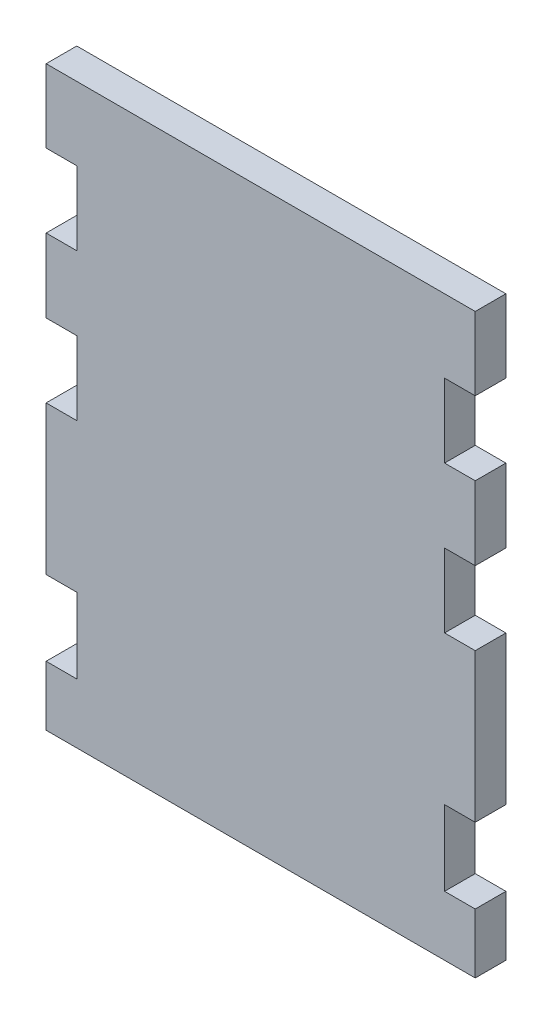
ISO-10303-21;
HEADER;
FILE_DESCRIPTION(('STEP AP214'),'2;1');
FILE_NAME('part.step','',(''),(''),'','','');
FILE_SCHEMA(('AUTOMOTIVE_DESIGN { 1 0 10303 214 1 1 1 1 }'));
ENDSEC;
DATA;
#1=APPLICATION_CONTEXT('core data for automotive mechanical design processes');
#2=APPLICATION_PROTOCOL_DEFINITION('international standard','automotive_design',2000,#1);
#3=PRODUCT_CONTEXT('',#1,'mechanical');
#4=PRODUCT('Part','Part','',(#3));
#5=PRODUCT_RELATED_PRODUCT_CATEGORY('part','',(#4));
#6=PRODUCT_DEFINITION_FORMATION('','',#4);
#7=PRODUCT_DEFINITION_CONTEXT('part definition',#1,'design');
#8=PRODUCT_DEFINITION('design','',#6,#7);
#9=PRODUCT_DEFINITION_SHAPE('','',#8);
#10=(LENGTH_UNIT() NAMED_UNIT(*) SI_UNIT(.MILLI.,.METRE.));
#11=(NAMED_UNIT(*) PLANE_ANGLE_UNIT() SI_UNIT($,.RADIAN.));
#12=(NAMED_UNIT(*) SI_UNIT($,.STERADIAN.) SOLID_ANGLE_UNIT());
#13=UNCERTAINTY_MEASURE_WITH_UNIT(LENGTH_MEASURE(1.E-05),#10,'distance_accuracy_value','');
#14=(GEOMETRIC_REPRESENTATION_CONTEXT(3) GLOBAL_UNCERTAINTY_ASSIGNED_CONTEXT((#13)) GLOBAL_UNIT_ASSIGNED_CONTEXT((#10,
#11,#12)) REPRESENTATION_CONTEXT('',''));
#15=CARTESIAN_POINT('',(0.,0.,0.));
#16=DIRECTION('',(0.,0.,1.));
#17=DIRECTION('',(1.,0.,0.));
#18=AXIS2_PLACEMENT_3D('',#15,#16,#17);
#19=CARTESIAN_POINT('',(0.,0.,3.));
#20=DIRECTION('',(1.,0.,0.));
#21=DIRECTION('',(0.,0.,-1.));
#22=AXIS2_PLACEMENT_3D('',#19,#20,#21);
#23=PLANE('',#22);
#24=DIRECTION('',(0.,-1.,0.));
#25=VECTOR('',#24,1.);
#26=CARTESIAN_POINT('',(0.,0.,0.));
#27=LINE('',#26,#25);
#28=CARTESIAN_POINT('',(0.,7.34818586641541,0.));
#29=VERTEX_POINT('',#28);
#30=CARTESIAN_POINT('',(0.,1.5,0.));
#31=VERTEX_POINT('',#30);
#32=EDGE_CURVE('E267',#29,#31,#27,.T.);
#33=ORIENTED_EDGE('',*,*,#32,.T.);
#34=DIRECTION('',(0.,0.,1.));
#35=VECTOR('',#34,1.);
#36=CARTESIAN_POINT('',(0.,1.5,0.));
#37=LINE('',#36,#35);
#38=CARTESIAN_POINT('',(0.,1.5,3.));
#39=VERTEX_POINT('',#38);
#40=EDGE_CURVE('E58',#31,#39,#37,.T.);
#41=ORIENTED_EDGE('',*,*,#40,.T.);
#42=DIRECTION('',(0.,-1.,0.));
#43=VECTOR('',#42,1.);
#44=CARTESIAN_POINT('',(0.,0.,3.));
#45=LINE('',#44,#43);
#46=CARTESIAN_POINT('',(0.,7.34818586641541,3.));
#47=VERTEX_POINT('',#46);
#48=EDGE_CURVE('E254',#47,#39,#45,.T.);
#49=ORIENTED_EDGE('',*,*,#48,.F.);
#50=DIRECTION('',(0.,0.,1.));
#51=VECTOR('',#50,1.);
#52=CARTESIAN_POINT('',(0.,7.34818586641541,0.));
#53=LINE('',#52,#51);
#54=EDGE_CURVE('E347',#29,#47,#53,.T.);
#55=ORIENTED_EDGE('',*,*,#54,.F.);
#56=EDGE_LOOP('',(#33,#41,#49,#55));
#57=FACE_BOUND('',#56,.T.);
#58=ADVANCED_FACE('F43',(#57),#23,.F.);
#59=CARTESIAN_POINT('',(0.,29.2481858590005,0.));
#60=VERTEX_POINT('',#59);
#61=CARTESIAN_POINT('',(0.,14.6981858664154,0.));
#62=VERTEX_POINT('',#61);
#63=EDGE_CURVE('E273',#60,#62,#27,.T.);
#64=ORIENTED_EDGE('',*,*,#63,.T.);
#65=DIRECTION('',(0.,0.,1.));
#66=VECTOR('',#65,1.);
#67=CARTESIAN_POINT('',(0.,14.6981858664154,0.));
#68=LINE('',#67,#66);
#69=CARTESIAN_POINT('',(0.,14.6981858664154,3.));
#70=VERTEX_POINT('',#69);
#71=EDGE_CURVE('E344',#62,#70,#68,.T.);
#72=ORIENTED_EDGE('',*,*,#71,.T.);
#73=CARTESIAN_POINT('',(0.,29.2481858590005,3.));
#74=VERTEX_POINT('',#73);
#75=EDGE_CURVE('E522',#74,#70,#45,.T.);
#76=ORIENTED_EDGE('',*,*,#75,.F.);
#77=DIRECTION('',(0.,0.,1.));
#78=VECTOR('',#77,1.);
#79=CARTESIAN_POINT('',(0.,29.2481858590005,0.));
#80=LINE('',#79,#78);
#81=EDGE_CURVE('E507',#60,#74,#80,.T.);
#82=ORIENTED_EDGE('',*,*,#81,.F.);
#83=EDGE_LOOP('',(#64,#72,#76,#82));
#84=FACE_BOUND('',#83,.T.);
#85=ADVANCED_FACE('F577',(#84),#23,.F.);
#86=CARTESIAN_POINT('',(0.,43.6481858518191,0.));
#87=VERTEX_POINT('',#86);
#88=CARTESIAN_POINT('',(0.,36.4481858554098,0.));
#89=VERTEX_POINT('',#88);
#90=EDGE_CURVE('E266',#87,#89,#27,.T.);
#91=ORIENTED_EDGE('',*,*,#90,.T.);
#92=DIRECTION('',(0.,0.,1.));
#93=VECTOR('',#92,1.);
#94=CARTESIAN_POINT('',(0.,36.4481858554098,0.));
#95=LINE('',#94,#93);
#96=CARTESIAN_POINT('',(0.,36.4481858554098,3.));
#97=VERTEX_POINT('',#96);
#98=EDGE_CURVE('E505',#89,#97,#95,.T.);
#99=ORIENTED_EDGE('',*,*,#98,.T.);
#100=CARTESIAN_POINT('',(0.,43.6481858518191,3.));
#101=VERTEX_POINT('',#100);
#102=EDGE_CURVE('E300',#101,#97,#45,.T.);
#103=ORIENTED_EDGE('',*,*,#102,.F.);
#104=DIRECTION('',(0.,0.,1.));
#105=VECTOR('',#104,1.);
#106=CARTESIAN_POINT('',(0.,43.6481858518191,0.));
#107=LINE('',#106,#105);
#108=EDGE_CURVE('E432',#87,#101,#107,.T.);
#109=ORIENTED_EDGE('',*,*,#108,.F.);
#110=EDGE_LOOP('',(#91,#99,#103,#109));
#111=FACE_BOUND('',#110,.T.);
#112=ADVANCED_FACE('F499',(#111),#23,.F.);
#113=CARTESIAN_POINT('',(42.,0.,3.));
#114=DIRECTION('',(-1.,0.,0.));
#115=DIRECTION('',(0.,0.,1.));
#116=AXIS2_PLACEMENT_3D('',#113,#114,#115);
#117=PLANE('',#116);
#118=DIRECTION('',(0.,1.,0.));
#119=VECTOR('',#118,1.);
#120=CARTESIAN_POINT('',(42.,0.,3.));
#121=LINE('',#120,#119);
#122=CARTESIAN_POINT('',(42.,36.4481858554098,3.));
#123=VERTEX_POINT('',#122);
#124=CARTESIAN_POINT('',(42.,43.6481858518191,3.));
#125=VERTEX_POINT('',#124);
#126=EDGE_CURVE('E465',#123,#125,#121,.T.);
#127=ORIENTED_EDGE('',*,*,#126,.F.);
#128=DIRECTION('',(0.,0.,1.));
#129=VECTOR('',#128,1.);
#130=CARTESIAN_POINT('',(42.,36.4481858554098,0.));
#131=LINE('',#130,#129);
#132=CARTESIAN_POINT('',(42.,36.4481858554098,0.));
#133=VERTEX_POINT('',#132);
#134=EDGE_CURVE('E378',#133,#123,#131,.T.);
#135=ORIENTED_EDGE('',*,*,#134,.F.);
#136=DIRECTION('',(0.,1.,0.));
#137=VECTOR('',#136,1.);
#138=CARTESIAN_POINT('',(42.,0.,0.));
#139=LINE('',#138,#137);
#140=CARTESIAN_POINT('',(42.,43.6481858518191,0.));
#141=VERTEX_POINT('',#140);
#142=EDGE_CURVE('E257',#133,#141,#139,.T.);
#143=ORIENTED_EDGE('',*,*,#142,.T.);
#144=DIRECTION('',(0.,0.,1.));
#145=VECTOR('',#144,1.);
#146=CARTESIAN_POINT('',(42.,43.6481858518191,0.));
#147=LINE('',#146,#145);
#148=EDGE_CURVE('E66',#141,#125,#147,.T.);
#149=ORIENTED_EDGE('',*,*,#148,.T.);
#150=EDGE_LOOP('',(#127,#135,#143,#149));
#151=FACE_BOUND('',#150,.T.);
#152=ADVANCED_FACE('F587',(#151),#117,.F.);
#153=CARTESIAN_POINT('',(42.,14.6981858664154,0.));
#154=VERTEX_POINT('',#153);
#155=CARTESIAN_POINT('',(42.,29.2481858590005,0.));
#156=VERTEX_POINT('',#155);
#157=EDGE_CURVE('E251',#154,#156,#139,.T.);
#158=ORIENTED_EDGE('',*,*,#157,.T.);
#159=DIRECTION('',(0.,0.,1.));
#160=VECTOR('',#159,1.);
#161=CARTESIAN_POINT('',(42.,29.2481858590005,0.));
#162=LINE('',#161,#160);
#163=CARTESIAN_POINT('',(42.,29.2481858590005,3.));
#164=VERTEX_POINT('',#163);
#165=EDGE_CURVE('E375',#156,#164,#162,.T.);
#166=ORIENTED_EDGE('',*,*,#165,.T.);
#167=CARTESIAN_POINT('',(42.,14.6981858664154,3.));
#168=VERTEX_POINT('',#167);
#169=EDGE_CURVE('E457',#168,#164,#121,.T.);
#170=ORIENTED_EDGE('',*,*,#169,.F.);
#171=DIRECTION('',(0.,0.,1.));
#172=VECTOR('',#171,1.);
#173=CARTESIAN_POINT('',(42.,14.6981858664154,0.));
#174=LINE('',#173,#172);
#175=EDGE_CURVE('E529',#154,#168,#174,.T.);
#176=ORIENTED_EDGE('',*,*,#175,.F.);
#177=EDGE_LOOP('',(#158,#166,#170,#176));
#178=FACE_BOUND('',#177,.T.);
#179=ADVANCED_FACE('F455',(#178),#117,.F.);
#180=CARTESIAN_POINT('',(42.,50.8481858482284,3.));
#181=VERTEX_POINT('',#180);
#182=CARTESIAN_POINT('',(42.,58.,3.));
#183=VERTEX_POINT('',#182);
#184=EDGE_CURVE('E299',#181,#183,#121,.T.);
#185=ORIENTED_EDGE('',*,*,#184,.F.);
#186=DIRECTION('',(0.,0.,1.));
#187=VECTOR('',#186,1.);
#188=CARTESIAN_POINT('',(42.,50.8481858482284,0.));
#189=LINE('',#188,#187);
#190=CARTESIAN_POINT('',(42.,50.8481858482284,0.));
#191=VERTEX_POINT('',#190);
#192=EDGE_CURVE('E279',#191,#181,#189,.T.);
#193=ORIENTED_EDGE('',*,*,#192,.F.);
#194=CARTESIAN_POINT('',(42.,58.,0.));
#195=VERTEX_POINT('',#194);
#196=EDGE_CURVE('E253',#191,#195,#139,.T.);
#197=ORIENTED_EDGE('',*,*,#196,.T.);
#198=DIRECTION('',(0.,0.,-1.));
#199=VECTOR('',#198,1.);
#200=CARTESIAN_POINT('',(42.,58.,3.));
#201=LINE('',#200,#199);
#202=EDGE_CURVE('E12',#183,#195,#201,.T.);
#203=ORIENTED_EDGE('',*,*,#202,.F.);
#204=EDGE_LOOP('',(#185,#193,#197,#203));
#205=FACE_BOUND('',#204,.T.);
#206=ADVANCED_FACE('F476',(#205),#117,.F.);
#207=CARTESIAN_POINT('',(0.,58.,0.));
#208=VERTEX_POINT('',#207);
#209=CARTESIAN_POINT('',(0.,50.8481858482284,0.));
#210=VERTEX_POINT('',#209);
#211=EDGE_CURVE('E259',#208,#210,#27,.T.);
#212=ORIENTED_EDGE('',*,*,#211,.T.);
#213=DIRECTION('',(0.,0.,1.));
#214=VECTOR('',#213,1.);
#215=CARTESIAN_POINT('',(0.,50.8481858482284,0.));
#216=LINE('',#215,#214);
#217=CARTESIAN_POINT('',(0.,50.8481858482284,3.));
#218=VERTEX_POINT('',#217);
#219=EDGE_CURVE('E434',#210,#218,#216,.T.);
#220=ORIENTED_EDGE('',*,*,#219,.T.);
#221=CARTESIAN_POINT('',(0.,58.,3.));
#222=VERTEX_POINT('',#221);
#223=EDGE_CURVE('E295',#222,#218,#45,.T.);
#224=ORIENTED_EDGE('',*,*,#223,.F.);
#225=DIRECTION('',(0.,0.,-1.));
#226=VECTOR('',#225,1.);
#227=CARTESIAN_POINT('',(0.,58.,3.));
#228=LINE('',#227,#226);
#229=EDGE_CURVE('E51',#222,#208,#228,.T.);
#230=ORIENTED_EDGE('',*,*,#229,.T.);
#231=EDGE_LOOP('',(#212,#220,#224,#230));
#232=FACE_BOUND('',#231,.T.);
#233=ADVANCED_FACE('F45',(#232),#23,.F.);
#234=CARTESIAN_POINT('',(42.,1.5,3.));
#235=VERTEX_POINT('',#234);
#236=CARTESIAN_POINT('',(42.,7.34818586641541,3.));
#237=VERTEX_POINT('',#236);
#238=EDGE_CURVE('E243',#235,#237,#121,.T.);
#239=ORIENTED_EDGE('',*,*,#238,.F.);
#240=DIRECTION('',(0.,0.,1.));
#241=VECTOR('',#240,1.);
#242=CARTESIAN_POINT('',(42.,1.5,0.));
#243=LINE('',#242,#241);
#244=CARTESIAN_POINT('',(42.,1.5,0.));
#245=VERTEX_POINT('',#244);
#246=EDGE_CURVE('E229',#245,#235,#243,.T.);
#247=ORIENTED_EDGE('',*,*,#246,.F.);
#248=CARTESIAN_POINT('',(42.,7.34818586641541,0.));
#249=VERTEX_POINT('',#248);
#250=EDGE_CURVE('E241',#245,#249,#139,.T.);
#251=ORIENTED_EDGE('',*,*,#250,.T.);
#252=DIRECTION('',(0.,0.,1.));
#253=VECTOR('',#252,1.);
#254=CARTESIAN_POINT('',(42.,7.34818586641541,0.));
#255=LINE('',#254,#253);
#256=EDGE_CURVE('E537',#249,#237,#255,.T.);
#257=ORIENTED_EDGE('',*,*,#256,.T.);
#258=EDGE_LOOP('',(#239,#247,#251,#257));
#259=FACE_BOUND('',#258,.T.);
#260=ADVANCED_FACE('F239',(#259),#117,.F.);
#261=CARTESIAN_POINT('',(0.,58.,3.));
#262=DIRECTION('',(0.,-1.,0.));
#263=DIRECTION('',(0.,0.,-1.));
#264=AXIS2_PLACEMENT_3D('',#261,#262,#263);
#265=PLANE('',#264);
#266=DIRECTION('',(-1.,0.,0.));
#267=VECTOR('',#266,1.);
#268=CARTESIAN_POINT('',(0.,58.,0.));
#269=LINE('',#268,#267);
#270=EDGE_CURVE('E250',#195,#208,#269,.T.);
#271=ORIENTED_EDGE('',*,*,#270,.T.);
#272=ORIENTED_EDGE('',*,*,#229,.F.);
#273=DIRECTION('',(-1.,0.,0.));
#274=VECTOR('',#273,1.);
#275=CARTESIAN_POINT('',(0.,58.,3.));
#276=LINE('',#275,#274);
#277=EDGE_CURVE('E466',#183,#222,#276,.T.);
#278=ORIENTED_EDGE('',*,*,#277,.F.);
#279=ORIENTED_EDGE('',*,*,#202,.T.);
#280=EDGE_LOOP('',(#271,#272,#278,#279));
#281=FACE_BOUND('',#280,.T.);
#282=ADVANCED_FACE('F479',(#281),#265,.F.);
#283=CARTESIAN_POINT('',(0.,0.,3.));
#284=DIRECTION('',(0.,0.,-1.));
#285=DIRECTION('',(-1.,0.,0.));
#286=AXIS2_PLACEMENT_3D('',#283,#284,#285);
#287=PLANE('',#286);
#288=ORIENTED_EDGE('',*,*,#48,.T.);
#289=DIRECTION('',(-1.,0.,0.));
#290=VECTOR('',#289,1.);
#291=CARTESIAN_POINT('',(0.,1.5,3.));
#292=LINE('',#291,#290);
#293=EDGE_CURVE('E235',#235,#39,#292,.T.);
#294=ORIENTED_EDGE('',*,*,#293,.F.);
#295=ORIENTED_EDGE('',*,*,#238,.T.);
#296=DIRECTION('',(1.,0.,0.));
#297=VECTOR('',#296,1.);
#298=CARTESIAN_POINT('',(38.9999999999977,7.34818586641541,3.));
#299=LINE('',#298,#297);
#300=CARTESIAN_POINT('',(38.9999999999977,7.34818586641541,3.));
#301=VERTEX_POINT('',#300);
#302=EDGE_CURVE('E542',#301,#237,#299,.T.);
#303=ORIENTED_EDGE('',*,*,#302,.F.);
#304=DIRECTION('',(0.,-1.,0.));
#305=VECTOR('',#304,1.);
#306=CARTESIAN_POINT('',(38.9999999999977,14.6981858664154,3.));
#307=LINE('',#306,#305);
#308=CARTESIAN_POINT('',(38.9999999999977,14.6981858664154,3.));
#309=VERTEX_POINT('',#308);
#310=EDGE_CURVE('E350',#309,#301,#307,.T.);
#311=ORIENTED_EDGE('',*,*,#310,.F.);
#312=DIRECTION('',(-1.,0.,0.));
#313=VECTOR('',#312,1.);
#314=CARTESIAN_POINT('',(38.9999999999977,14.6981858664154,3.));
#315=LINE('',#314,#313);
#316=EDGE_CURVE('E464',#168,#309,#315,.T.);
#317=ORIENTED_EDGE('',*,*,#316,.F.);
#318=ORIENTED_EDGE('',*,*,#169,.T.);
#319=DIRECTION('',(1.,0.,0.));
#320=VECTOR('',#319,1.);
#321=CARTESIAN_POINT('',(38.9999999999977,29.2481858590005,3.));
#322=LINE('',#321,#320);
#323=CARTESIAN_POINT('',(38.9999999999977,29.2481858590005,3.));
#324=VERTEX_POINT('',#323);
#325=EDGE_CURVE('E387',#324,#164,#322,.T.);
#326=ORIENTED_EDGE('',*,*,#325,.F.);
#327=DIRECTION('',(0.,-1.,0.));
#328=VECTOR('',#327,1.);
#329=CARTESIAN_POINT('',(38.9999999999977,36.4481858554098,3.));
#330=LINE('',#329,#328);
#331=CARTESIAN_POINT('',(38.9999999999977,36.4481858554098,3.));
#332=VERTEX_POINT('',#331);
#333=EDGE_CURVE('E404',#332,#324,#330,.T.);
#334=ORIENTED_EDGE('',*,*,#333,.F.);
#335=DIRECTION('',(-1.,0.,0.));
#336=VECTOR('',#335,1.);
#337=CARTESIAN_POINT('',(38.9999999999977,36.4481858554098,3.));
#338=LINE('',#337,#336);
#339=EDGE_CURVE('E383',#123,#332,#338,.T.);
#340=ORIENTED_EDGE('',*,*,#339,.F.);
#341=ORIENTED_EDGE('',*,*,#126,.T.);
#342=DIRECTION('',(1.,0.,0.));
#343=VECTOR('',#342,1.);
#344=CARTESIAN_POINT('',(38.9999999999977,43.6481858518191,3.));
#345=LINE('',#344,#343);
#346=CARTESIAN_POINT('',(38.9999999999977,43.6481858518191,3.));
#347=VERTEX_POINT('',#346);
#348=EDGE_CURVE('E399',#347,#125,#345,.T.);
#349=ORIENTED_EDGE('',*,*,#348,.F.);
#350=DIRECTION('',(0.,-1.,0.));
#351=VECTOR('',#350,1.);
#352=CARTESIAN_POINT('',(38.9999999999977,50.8481858482284,3.));
#353=LINE('',#352,#351);
#354=CARTESIAN_POINT('',(38.9999999999977,50.8481858482284,3.));
#355=VERTEX_POINT('',#354);
#356=EDGE_CURVE('E401',#355,#347,#353,.T.);
#357=ORIENTED_EDGE('',*,*,#356,.F.);
#358=DIRECTION('',(-1.,0.,0.));
#359=VECTOR('',#358,1.);
#360=CARTESIAN_POINT('',(38.9999999999977,50.8481858482284,3.));
#361=LINE('',#360,#359);
#362=EDGE_CURVE('E287',#181,#355,#361,.T.);
#363=ORIENTED_EDGE('',*,*,#362,.F.);
#364=ORIENTED_EDGE('',*,*,#184,.T.);
#365=ORIENTED_EDGE('',*,*,#277,.T.);
#366=ORIENTED_EDGE('',*,*,#223,.T.);
#367=DIRECTION('',(-1.,0.,0.));
#368=VECTOR('',#367,1.);
#369=CARTESIAN_POINT('',(3.00000000000001,50.8481858482284,3.));
#370=LINE('',#369,#368);
#371=CARTESIAN_POINT('',(3.00000000000001,50.8481858482284,3.));
#372=VERTEX_POINT('',#371);
#373=EDGE_CURVE('E426',#372,#218,#370,.T.);
#374=ORIENTED_EDGE('',*,*,#373,.F.);
#375=DIRECTION('',(0.,1.,0.));
#376=VECTOR('',#375,1.);
#377=CARTESIAN_POINT('',(3.00000000000001,50.8481858482284,3.));
#378=LINE('',#377,#376);
#379=CARTESIAN_POINT('',(3.00000000000001,43.6481858518191,3.));
#380=VERTEX_POINT('',#379);
#381=EDGE_CURVE('E382',#380,#372,#378,.T.);
#382=ORIENTED_EDGE('',*,*,#381,.F.);
#383=DIRECTION('',(1.,0.,0.));
#384=VECTOR('',#383,1.);
#385=CARTESIAN_POINT('',(3.00000000000001,43.6481858518191,3.));
#386=LINE('',#385,#384);
#387=EDGE_CURVE('E415',#101,#380,#386,.T.);
#388=ORIENTED_EDGE('',*,*,#387,.F.);
#389=ORIENTED_EDGE('',*,*,#102,.T.);
#390=DIRECTION('',(-1.,0.,0.));
#391=VECTOR('',#390,1.);
#392=CARTESIAN_POINT('',(3.00000000000001,36.4481858554098,3.));
#393=LINE('',#392,#391);
#394=CARTESIAN_POINT('',(3.00000000000001,36.4481858554098,3.));
#395=VERTEX_POINT('',#394);
#396=EDGE_CURVE('E320',#395,#97,#393,.T.);
#397=ORIENTED_EDGE('',*,*,#396,.F.);
#398=DIRECTION('',(0.,1.,0.));
#399=VECTOR('',#398,1.);
#400=CARTESIAN_POINT('',(3.00000000000001,36.4481858554098,3.));
#401=LINE('',#400,#399);
#402=CARTESIAN_POINT('',(3.00000000000001,29.2481858590005,3.));
#403=VERTEX_POINT('',#402);
#404=EDGE_CURVE('E323',#403,#395,#401,.T.);
#405=ORIENTED_EDGE('',*,*,#404,.F.);
#406=DIRECTION('',(1.,0.,0.));
#407=VECTOR('',#406,1.);
#408=CARTESIAN_POINT('',(3.00000000000001,29.2481858590005,3.));
#409=LINE('',#408,#407);
#410=EDGE_CURVE('E324',#74,#403,#409,.T.);
#411=ORIENTED_EDGE('',*,*,#410,.F.);
#412=ORIENTED_EDGE('',*,*,#75,.T.);
#413=DIRECTION('',(-1.,0.,0.));
#414=VECTOR('',#413,1.);
#415=CARTESIAN_POINT('',(2.99999999999999,14.6981858664154,3.));
#416=LINE('',#415,#414);
#417=CARTESIAN_POINT('',(2.99999999999999,14.6981858664154,3.));
#418=VERTEX_POINT('',#417);
#419=EDGE_CURVE('E355',#418,#70,#416,.T.);
#420=ORIENTED_EDGE('',*,*,#419,.F.);
#421=DIRECTION('',(0.,1.,0.));
#422=VECTOR('',#421,1.);
#423=CARTESIAN_POINT('',(2.99999999999999,14.6981858664154,3.));
#424=LINE('',#423,#422);
#425=CARTESIAN_POINT('',(2.99999999999999,7.34818586641541,3.));
#426=VERTEX_POINT('',#425);
#427=EDGE_CURVE('E359',#426,#418,#424,.T.);
#428=ORIENTED_EDGE('',*,*,#427,.F.);
#429=DIRECTION('',(1.,0.,0.));
#430=VECTOR('',#429,1.);
#431=CARTESIAN_POINT('',(2.99999999999999,7.34818586641541,3.));
#432=LINE('',#431,#430);
#433=EDGE_CURVE('E351',#47,#426,#432,.T.);
#434=ORIENTED_EDGE('',*,*,#433,.F.);
#435=EDGE_LOOP('',(#288,#294,#295,#303,#311,#317,#318,#326,#334,#340,#341,#349,#357,#363,#364,
#365,#366,#374,#382,#388,#389,#397,#405,#411,#412,#420,#428,#434));
#436=FACE_BOUND('',#435,.T.);
#437=ADVANCED_FACE('F461',(#436),#287,.F.);
#438=CARTESIAN_POINT('',(0.,0.,0.));
#439=DIRECTION('',(0.,0.,-1.));
#440=DIRECTION('',(-1.,0.,0.));
#441=AXIS2_PLACEMENT_3D('',#438,#439,#440);
#442=PLANE('',#441);
#443=DIRECTION('',(-1.,0.,0.));
#444=VECTOR('',#443,1.);
#445=CARTESIAN_POINT('',(0.,1.5,0.));
#446=LINE('',#445,#444);
#447=EDGE_CURVE('E226',#245,#31,#446,.T.);
#448=ORIENTED_EDGE('',*,*,#447,.T.);
#449=ORIENTED_EDGE('',*,*,#32,.F.);
#450=DIRECTION('',(1.,0.,0.));
#451=VECTOR('',#450,1.);
#452=CARTESIAN_POINT('',(2.99999999999999,7.34818586641541,0.));
#453=LINE('',#452,#451);
#454=CARTESIAN_POINT('',(2.99999999999999,7.34818586641541,0.));
#455=VERTEX_POINT('',#454);
#456=EDGE_CURVE('E343',#29,#455,#453,.T.);
#457=ORIENTED_EDGE('',*,*,#456,.T.);
#458=DIRECTION('',(0.,1.,0.));
#459=VECTOR('',#458,1.);
#460=CARTESIAN_POINT('',(2.99999999999999,14.6981858664154,0.));
#461=LINE('',#460,#459);
#462=CARTESIAN_POINT('',(2.99999999999999,14.6981858664154,0.));
#463=VERTEX_POINT('',#462);
#464=EDGE_CURVE('E356',#455,#463,#461,.T.);
#465=ORIENTED_EDGE('',*,*,#464,.T.);
#466=DIRECTION('',(-1.,0.,0.));
#467=VECTOR('',#466,1.);
#468=CARTESIAN_POINT('',(2.99999999999999,14.6981858664154,0.));
#469=LINE('',#468,#467);
#470=EDGE_CURVE('E367',#463,#62,#469,.T.);
#471=ORIENTED_EDGE('',*,*,#470,.T.);
#472=ORIENTED_EDGE('',*,*,#63,.F.);
#473=DIRECTION('',(1.,0.,0.));
#474=VECTOR('',#473,1.);
#475=CARTESIAN_POINT('',(3.00000000000001,29.2481858590005,0.));
#476=LINE('',#475,#474);
#477=CARTESIAN_POINT('',(3.00000000000001,29.2481858590005,0.));
#478=VERTEX_POINT('',#477);
#479=EDGE_CURVE('E331',#60,#478,#476,.T.);
#480=ORIENTED_EDGE('',*,*,#479,.T.);
#481=DIRECTION('',(0.,1.,0.));
#482=VECTOR('',#481,1.);
#483=CARTESIAN_POINT('',(3.00000000000001,36.4481858554098,0.));
#484=LINE('',#483,#482);
#485=CARTESIAN_POINT('',(3.00000000000001,36.4481858554098,0.));
#486=VERTEX_POINT('',#485);
#487=EDGE_CURVE('E338',#478,#486,#484,.T.);
#488=ORIENTED_EDGE('',*,*,#487,.T.);
#489=DIRECTION('',(-1.,0.,0.));
#490=VECTOR('',#489,1.);
#491=CARTESIAN_POINT('',(3.00000000000001,36.4481858554098,0.));
#492=LINE('',#491,#490);
#493=EDGE_CURVE('E334',#486,#89,#492,.T.);
#494=ORIENTED_EDGE('',*,*,#493,.T.);
#495=ORIENTED_EDGE('',*,*,#90,.F.);
#496=DIRECTION('',(1.,0.,0.));
#497=VECTOR('',#496,1.);
#498=CARTESIAN_POINT('',(3.00000000000001,43.6481858518191,0.));
#499=LINE('',#498,#497);
#500=CARTESIAN_POINT('',(3.00000000000001,43.6481858518191,0.));
#501=VERTEX_POINT('',#500);
#502=EDGE_CURVE('E419',#87,#501,#499,.T.);
#503=ORIENTED_EDGE('',*,*,#502,.T.);
#504=DIRECTION('',(0.,1.,0.));
#505=VECTOR('',#504,1.);
#506=CARTESIAN_POINT('',(3.00000000000001,50.8481858482284,0.));
#507=LINE('',#506,#505);
#508=CARTESIAN_POINT('',(3.00000000000001,50.8481858482284,0.));
#509=VERTEX_POINT('',#508);
#510=EDGE_CURVE('E412',#501,#509,#507,.T.);
#511=ORIENTED_EDGE('',*,*,#510,.T.);
#512=DIRECTION('',(-1.,0.,0.));
#513=VECTOR('',#512,1.);
#514=CARTESIAN_POINT('',(3.00000000000001,50.8481858482284,0.));
#515=LINE('',#514,#513);
#516=EDGE_CURVE('E416',#509,#210,#515,.T.);
#517=ORIENTED_EDGE('',*,*,#516,.T.);
#518=ORIENTED_EDGE('',*,*,#211,.F.);
#519=ORIENTED_EDGE('',*,*,#270,.F.);
#520=ORIENTED_EDGE('',*,*,#196,.F.);
#521=DIRECTION('',(-1.,0.,0.));
#522=VECTOR('',#521,1.);
#523=CARTESIAN_POINT('',(38.9999999999977,50.8481858482284,0.));
#524=LINE('',#523,#522);
#525=CARTESIAN_POINT('',(38.9999999999977,50.8481858482284,0.));
#526=VERTEX_POINT('',#525);
#527=EDGE_CURVE('E294',#191,#526,#524,.T.);
#528=ORIENTED_EDGE('',*,*,#527,.T.);
#529=DIRECTION('',(0.,-1.,0.));
#530=VECTOR('',#529,1.);
#531=CARTESIAN_POINT('',(38.9999999999977,50.8481858482284,0.));
#532=LINE('',#531,#530);
#533=CARTESIAN_POINT('',(38.9999999999977,43.6481858518191,0.));
#534=VERTEX_POINT('',#533);
#535=EDGE_CURVE('E409',#526,#534,#532,.T.);
#536=ORIENTED_EDGE('',*,*,#535,.T.);
#537=DIRECTION('',(1.,0.,0.));
#538=VECTOR('',#537,1.);
#539=CARTESIAN_POINT('',(38.9999999999977,43.6481858518191,0.));
#540=LINE('',#539,#538);
#541=EDGE_CURVE('E407',#534,#141,#540,.T.);
#542=ORIENTED_EDGE('',*,*,#541,.T.);
#543=ORIENTED_EDGE('',*,*,#142,.F.);
#544=DIRECTION('',(-1.,0.,0.));
#545=VECTOR('',#544,1.);
#546=CARTESIAN_POINT('',(38.9999999999977,36.4481858554098,0.));
#547=LINE('',#546,#545);
#548=CARTESIAN_POINT('',(38.9999999999977,36.4481858554098,0.));
#549=VERTEX_POINT('',#548);
#550=EDGE_CURVE('E374',#133,#549,#547,.T.);
#551=ORIENTED_EDGE('',*,*,#550,.T.);
#552=DIRECTION('',(0.,-1.,0.));
#553=VECTOR('',#552,1.);
#554=CARTESIAN_POINT('',(38.9999999999977,36.4481858554098,0.));
#555=LINE('',#554,#553);
#556=CARTESIAN_POINT('',(38.9999999999977,29.2481858590005,0.));
#557=VERTEX_POINT('',#556);
#558=EDGE_CURVE('E388',#549,#557,#555,.T.);
#559=ORIENTED_EDGE('',*,*,#558,.T.);
#560=DIRECTION('',(1.,0.,0.));
#561=VECTOR('',#560,1.);
#562=CARTESIAN_POINT('',(38.9999999999977,29.2481858590005,0.));
#563=LINE('',#562,#561);
#564=EDGE_CURVE('E439',#557,#156,#563,.T.);
#565=ORIENTED_EDGE('',*,*,#564,.T.);
#566=ORIENTED_EDGE('',*,*,#157,.F.);
#567=DIRECTION('',(-1.,0.,0.));
#568=VECTOR('',#567,1.);
#569=CARTESIAN_POINT('',(38.9999999999977,14.6981858664154,0.));
#570=LINE('',#569,#568);
#571=CARTESIAN_POINT('',(38.9999999999977,14.6981858664154,0.));
#572=VERTEX_POINT('',#571);
#573=EDGE_CURVE('E536',#154,#572,#570,.T.);
#574=ORIENTED_EDGE('',*,*,#573,.T.);
#575=DIRECTION('',(0.,-1.,0.));
#576=VECTOR('',#575,1.);
#577=CARTESIAN_POINT('',(38.9999999999977,14.6981858664154,0.));
#578=LINE('',#577,#576);
#579=CARTESIAN_POINT('',(38.9999999999977,7.34818586641541,0.));
#580=VERTEX_POINT('',#579);
#581=EDGE_CURVE('E543',#572,#580,#578,.T.);
#582=ORIENTED_EDGE('',*,*,#581,.T.);
#583=DIRECTION('',(1.,0.,0.));
#584=VECTOR('',#583,1.);
#585=CARTESIAN_POINT('',(38.9999999999977,7.34818586641541,0.));
#586=LINE('',#585,#584);
#587=EDGE_CURVE('E249',#580,#249,#586,.T.);
#588=ORIENTED_EDGE('',*,*,#587,.T.);
#589=ORIENTED_EDGE('',*,*,#250,.F.);
#590=EDGE_LOOP('',(#448,#449,#457,#465,#471,#472,#480,#488,#494,#495,#503,#511,#517,#518,#519,
#520,#528,#536,#542,#543,#551,#559,#565,#566,#574,#582,#588,#589));
#591=FACE_BOUND('',#590,.T.);
#592=ADVANCED_FACE('F246',(#591),#442,.T.);
#593=CARTESIAN_POINT('',(38.9999999999977,50.8481858482284,0.));
#594=DIRECTION('',(-1.,0.,0.));
#595=DIRECTION('',(0.,0.,1.));
#596=AXIS2_PLACEMENT_3D('',#593,#594,#595);
#597=PLANE('',#596);
#598=ORIENTED_EDGE('',*,*,#356,.T.);
#599=DIRECTION('',(0.,0.,1.));
#600=VECTOR('',#599,1.);
#601=CARTESIAN_POINT('',(38.9999999999977,43.6481858518191,0.));
#602=LINE('',#601,#600);
#603=EDGE_CURVE('E292',#534,#347,#602,.T.);
#604=ORIENTED_EDGE('',*,*,#603,.F.);
#605=ORIENTED_EDGE('',*,*,#535,.F.);
#606=DIRECTION('',(0.,0.,1.));
#607=VECTOR('',#606,1.);
#608=CARTESIAN_POINT('',(38.9999999999977,50.8481858482284,0.));
#609=LINE('',#608,#607);
#610=EDGE_CURVE('E275',#526,#355,#609,.T.);
#611=ORIENTED_EDGE('',*,*,#610,.T.);
#612=EDGE_LOOP('',(#598,#604,#605,#611));
#613=FACE_BOUND('',#612,.T.);
#614=ADVANCED_FACE('F601',(#613),#597,.F.);
#615=CARTESIAN_POINT('',(38.9999999999977,50.8481858482284,0.));
#616=DIRECTION('',(0.,1.,0.));
#617=DIRECTION('',(0.,0.,1.));
#618=AXIS2_PLACEMENT_3D('',#615,#616,#617);
#619=PLANE('',#618);
#620=ORIENTED_EDGE('',*,*,#362,.T.);
#621=ORIENTED_EDGE('',*,*,#610,.F.);
#622=ORIENTED_EDGE('',*,*,#527,.F.);
#623=ORIENTED_EDGE('',*,*,#192,.T.);
#624=EDGE_LOOP('',(#620,#621,#622,#623));
#625=FACE_BOUND('',#624,.T.);
#626=ADVANCED_FACE('F606',(#625),#619,.F.);
#627=CARTESIAN_POINT('',(38.9999999999977,43.6481858518191,0.));
#628=DIRECTION('',(0.,-1.,0.));
#629=DIRECTION('',(0.,0.,-1.));
#630=AXIS2_PLACEMENT_3D('',#627,#628,#629);
#631=PLANE('',#630);
#632=ORIENTED_EDGE('',*,*,#348,.T.);
#633=ORIENTED_EDGE('',*,*,#148,.F.);
#634=ORIENTED_EDGE('',*,*,#541,.F.);
#635=ORIENTED_EDGE('',*,*,#603,.T.);
#636=EDGE_LOOP('',(#632,#633,#634,#635));
#637=FACE_BOUND('',#636,.T.);
#638=ADVANCED_FACE('F607',(#637),#631,.F.);
#639=CARTESIAN_POINT('',(38.9999999999977,14.6981858664154,0.));
#640=DIRECTION('',(-1.,0.,0.));
#641=DIRECTION('',(0.,0.,1.));
#642=AXIS2_PLACEMENT_3D('',#639,#640,#641);
#643=PLANE('',#642);
#644=ORIENTED_EDGE('',*,*,#310,.T.);
#645=DIRECTION('',(0.,0.,1.));
#646=VECTOR('',#645,1.);
#647=CARTESIAN_POINT('',(38.9999999999977,7.34818586641541,0.));
#648=LINE('',#647,#646);
#649=EDGE_CURVE('E534',#580,#301,#648,.T.);
#650=ORIENTED_EDGE('',*,*,#649,.F.);
#651=ORIENTED_EDGE('',*,*,#581,.F.);
#652=DIRECTION('',(0.,0.,1.));
#653=VECTOR('',#652,1.);
#654=CARTESIAN_POINT('',(38.9999999999977,14.6981858664154,0.));
#655=LINE('',#654,#653);
#656=EDGE_CURVE('E527',#572,#309,#655,.T.);
#657=ORIENTED_EDGE('',*,*,#656,.T.);
#658=EDGE_LOOP('',(#644,#650,#651,#657));
#659=FACE_BOUND('',#658,.T.);
#660=ADVANCED_FACE('F558',(#659),#643,.F.);
#661=CARTESIAN_POINT('',(38.9999999999977,14.6981858664154,0.));
#662=DIRECTION('',(0.,1.,0.));
#663=DIRECTION('',(0.,0.,1.));
#664=AXIS2_PLACEMENT_3D('',#661,#662,#663);
#665=PLANE('',#664);
#666=ORIENTED_EDGE('',*,*,#316,.T.);
#667=ORIENTED_EDGE('',*,*,#656,.F.);
#668=ORIENTED_EDGE('',*,*,#573,.F.);
#669=ORIENTED_EDGE('',*,*,#175,.T.);
#670=EDGE_LOOP('',(#666,#667,#668,#669));
#671=FACE_BOUND('',#670,.T.);
#672=ADVANCED_FACE('F565',(#671),#665,.F.);
#673=CARTESIAN_POINT('',(38.9999999999977,7.34818586641541,0.));
#674=DIRECTION('',(0.,-1.,0.));
#675=DIRECTION('',(0.,0.,-1.));
#676=AXIS2_PLACEMENT_3D('',#673,#674,#675);
#677=PLANE('',#676);
#678=ORIENTED_EDGE('',*,*,#302,.T.);
#679=ORIENTED_EDGE('',*,*,#256,.F.);
#680=ORIENTED_EDGE('',*,*,#587,.F.);
#681=ORIENTED_EDGE('',*,*,#649,.T.);
#682=EDGE_LOOP('',(#678,#679,#680,#681));
#683=FACE_BOUND('',#682,.T.);
#684=ADVANCED_FACE('F562',(#683),#677,.F.);
#685=CARTESIAN_POINT('',(38.9999999999977,36.4481858554098,0.));
#686=DIRECTION('',(-1.,0.,0.));
#687=DIRECTION('',(0.,0.,1.));
#688=AXIS2_PLACEMENT_3D('',#685,#686,#687);
#689=PLANE('',#688);
#690=ORIENTED_EDGE('',*,*,#333,.T.);
#691=DIRECTION('',(0.,0.,1.));
#692=VECTOR('',#691,1.);
#693=CARTESIAN_POINT('',(38.9999999999977,29.2481858590005,0.));
#694=LINE('',#693,#692);
#695=EDGE_CURVE('E372',#557,#324,#694,.T.);
#696=ORIENTED_EDGE('',*,*,#695,.F.);
#697=ORIENTED_EDGE('',*,*,#558,.F.);
#698=DIRECTION('',(0.,0.,1.));
#699=VECTOR('',#698,1.);
#700=CARTESIAN_POINT('',(38.9999999999977,36.4481858554098,0.));
#701=LINE('',#700,#699);
#702=EDGE_CURVE('E380',#549,#332,#701,.T.);
#703=ORIENTED_EDGE('',*,*,#702,.T.);
#704=EDGE_LOOP('',(#690,#696,#697,#703));
#705=FACE_BOUND('',#704,.T.);
#706=ADVANCED_FACE('F564',(#705),#689,.F.);
#707=CARTESIAN_POINT('',(38.9999999999977,36.4481858554098,0.));
#708=DIRECTION('',(0.,1.,0.));
#709=DIRECTION('',(0.,0.,1.));
#710=AXIS2_PLACEMENT_3D('',#707,#708,#709);
#711=PLANE('',#710);
#712=ORIENTED_EDGE('',*,*,#339,.T.);
#713=ORIENTED_EDGE('',*,*,#702,.F.);
#714=ORIENTED_EDGE('',*,*,#550,.F.);
#715=ORIENTED_EDGE('',*,*,#134,.T.);
#716=EDGE_LOOP('',(#712,#713,#714,#715));
#717=FACE_BOUND('',#716,.T.);
#718=ADVANCED_FACE('F571',(#717),#711,.F.);
#719=CARTESIAN_POINT('',(38.9999999999977,29.2481858590005,0.));
#720=DIRECTION('',(0.,-1.,0.));
#721=DIRECTION('',(0.,0.,-1.));
#722=AXIS2_PLACEMENT_3D('',#719,#720,#721);
#723=PLANE('',#722);
#724=ORIENTED_EDGE('',*,*,#325,.T.);
#725=ORIENTED_EDGE('',*,*,#165,.F.);
#726=ORIENTED_EDGE('',*,*,#564,.F.);
#727=ORIENTED_EDGE('',*,*,#695,.T.);
#728=EDGE_LOOP('',(#724,#725,#726,#727));
#729=FACE_BOUND('',#728,.T.);
#730=ADVANCED_FACE('F449',(#729),#723,.F.);
#731=CARTESIAN_POINT('',(3.00000000000001,50.8481858482284,0.));
#732=DIRECTION('',(1.,0.,0.));
#733=DIRECTION('',(0.,1.,0.));
#734=AXIS2_PLACEMENT_3D('',#731,#732,#733);
#735=PLANE('',#734);
#736=ORIENTED_EDGE('',*,*,#381,.T.);
#737=DIRECTION('',(0.,0.,1.));
#738=VECTOR('',#737,1.);
#739=CARTESIAN_POINT('',(3.00000000000001,50.8481858482284,0.));
#740=LINE('',#739,#738);
#741=EDGE_CURVE('E422',#509,#372,#740,.T.);
#742=ORIENTED_EDGE('',*,*,#741,.F.);
#743=ORIENTED_EDGE('',*,*,#510,.F.);
#744=DIRECTION('',(0.,0.,1.));
#745=VECTOR('',#744,1.);
#746=CARTESIAN_POINT('',(3.00000000000001,43.6481858518191,0.));
#747=LINE('',#746,#745);
#748=EDGE_CURVE('E330',#501,#380,#747,.T.);
#749=ORIENTED_EDGE('',*,*,#748,.T.);
#750=EDGE_LOOP('',(#736,#742,#743,#749));
#751=FACE_BOUND('',#750,.T.);
#752=ADVANCED_FACE('F493',(#751),#735,.F.);
#753=CARTESIAN_POINT('',(3.00000000000001,43.6481858518191,0.));
#754=DIRECTION('',(0.,-1.,0.));
#755=DIRECTION('',(0.,0.,-1.));
#756=AXIS2_PLACEMENT_3D('',#753,#754,#755);
#757=PLANE('',#756);
#758=ORIENTED_EDGE('',*,*,#387,.T.);
#759=ORIENTED_EDGE('',*,*,#748,.F.);
#760=ORIENTED_EDGE('',*,*,#502,.F.);
#761=ORIENTED_EDGE('',*,*,#108,.T.);
#762=EDGE_LOOP('',(#758,#759,#760,#761));
#763=FACE_BOUND('',#762,.T.);
#764=ADVANCED_FACE('F495',(#763),#757,.F.);
#765=CARTESIAN_POINT('',(3.00000000000001,50.8481858482284,0.));
#766=DIRECTION('',(0.,1.,0.));
#767=DIRECTION('',(0.,0.,1.));
#768=AXIS2_PLACEMENT_3D('',#765,#766,#767);
#769=PLANE('',#768);
#770=ORIENTED_EDGE('',*,*,#373,.T.);
#771=ORIENTED_EDGE('',*,*,#219,.F.);
#772=ORIENTED_EDGE('',*,*,#516,.F.);
#773=ORIENTED_EDGE('',*,*,#741,.T.);
#774=EDGE_LOOP('',(#770,#771,#772,#773));
#775=FACE_BOUND('',#774,.T.);
#776=ADVANCED_FACE('F486',(#775),#769,.F.);
#777=CARTESIAN_POINT('',(3.00000000000001,36.4481858554098,0.));
#778=DIRECTION('',(1.,0.,0.));
#779=DIRECTION('',(0.,1.,0.));
#780=AXIS2_PLACEMENT_3D('',#777,#778,#779);
#781=PLANE('',#780);
#782=ORIENTED_EDGE('',*,*,#404,.T.);
#783=DIRECTION('',(0.,0.,1.));
#784=VECTOR('',#783,1.);
#785=CARTESIAN_POINT('',(3.00000000000001,36.4481858554098,0.));
#786=LINE('',#785,#784);
#787=EDGE_CURVE('E335',#486,#395,#786,.T.);
#788=ORIENTED_EDGE('',*,*,#787,.F.);
#789=ORIENTED_EDGE('',*,*,#487,.F.);
#790=DIRECTION('',(0.,0.,1.));
#791=VECTOR('',#790,1.);
#792=CARTESIAN_POINT('',(3.00000000000001,29.2481858590005,0.));
#793=LINE('',#792,#791);
#794=EDGE_CURVE('E364',#478,#403,#793,.T.);
#795=ORIENTED_EDGE('',*,*,#794,.T.);
#796=EDGE_LOOP('',(#782,#788,#789,#795));
#797=FACE_BOUND('',#796,.T.);
#798=ADVANCED_FACE('F514',(#797),#781,.F.);
#799=CARTESIAN_POINT('',(3.00000000000001,29.2481858590005,0.));
#800=DIRECTION('',(0.,-1.,0.));
#801=DIRECTION('',(0.,0.,-1.));
#802=AXIS2_PLACEMENT_3D('',#799,#800,#801);
#803=PLANE('',#802);
#804=ORIENTED_EDGE('',*,*,#410,.T.);
#805=ORIENTED_EDGE('',*,*,#794,.F.);
#806=ORIENTED_EDGE('',*,*,#479,.F.);
#807=ORIENTED_EDGE('',*,*,#81,.T.);
#808=EDGE_LOOP('',(#804,#805,#806,#807));
#809=FACE_BOUND('',#808,.T.);
#810=ADVANCED_FACE('F518',(#809),#803,.F.);
#811=CARTESIAN_POINT('',(3.00000000000001,36.4481858554098,0.));
#812=DIRECTION('',(0.,1.,0.));
#813=DIRECTION('',(0.,0.,1.));
#814=AXIS2_PLACEMENT_3D('',#811,#812,#813);
#815=PLANE('',#814);
#816=ORIENTED_EDGE('',*,*,#396,.T.);
#817=ORIENTED_EDGE('',*,*,#98,.F.);
#818=ORIENTED_EDGE('',*,*,#493,.F.);
#819=ORIENTED_EDGE('',*,*,#787,.T.);
#820=EDGE_LOOP('',(#816,#817,#818,#819));
#821=FACE_BOUND('',#820,.T.);
#822=ADVANCED_FACE('F504',(#821),#815,.F.);
#823=CARTESIAN_POINT('',(2.99999999999999,14.6981858664154,0.));
#824=DIRECTION('',(1.,0.,0.));
#825=DIRECTION('',(0.,0.,-1.));
#826=AXIS2_PLACEMENT_3D('',#823,#824,#825);
#827=PLANE('',#826);
#828=ORIENTED_EDGE('',*,*,#427,.T.);
#829=DIRECTION('',(0.,0.,1.));
#830=VECTOR('',#829,1.);
#831=CARTESIAN_POINT('',(2.99999999999999,14.6981858664154,0.));
#832=LINE('',#831,#830);
#833=EDGE_CURVE('E341',#463,#418,#832,.T.);
#834=ORIENTED_EDGE('',*,*,#833,.F.);
#835=ORIENTED_EDGE('',*,*,#464,.F.);
#836=DIRECTION('',(0.,0.,1.));
#837=VECTOR('',#836,1.);
#838=CARTESIAN_POINT('',(2.99999999999999,7.34818586641541,0.));
#839=LINE('',#838,#837);
#840=EDGE_CURVE('E349',#455,#426,#839,.T.);
#841=ORIENTED_EDGE('',*,*,#840,.T.);
#842=EDGE_LOOP('',(#828,#834,#835,#841));
#843=FACE_BOUND('',#842,.T.);
#844=ADVANCED_FACE('F628',(#843),#827,.F.);
#845=CARTESIAN_POINT('',(2.99999999999999,7.34818586641541,0.));
#846=DIRECTION('',(0.,-1.,0.));
#847=DIRECTION('',(0.,0.,-1.));
#848=AXIS2_PLACEMENT_3D('',#845,#846,#847);
#849=PLANE('',#848);
#850=ORIENTED_EDGE('',*,*,#433,.T.);
#851=ORIENTED_EDGE('',*,*,#840,.F.);
#852=ORIENTED_EDGE('',*,*,#456,.F.);
#853=ORIENTED_EDGE('',*,*,#54,.T.);
#854=EDGE_LOOP('',(#850,#851,#852,#853));
#855=FACE_BOUND('',#854,.T.);
#856=ADVANCED_FACE('F624',(#855),#849,.F.);
#857=CARTESIAN_POINT('',(2.99999999999999,14.6981858664154,0.));
#858=DIRECTION('',(0.,1.,0.));
#859=DIRECTION('',(0.,0.,1.));
#860=AXIS2_PLACEMENT_3D('',#857,#858,#859);
#861=PLANE('',#860);
#862=ORIENTED_EDGE('',*,*,#419,.T.);
#863=ORIENTED_EDGE('',*,*,#71,.F.);
#864=ORIENTED_EDGE('',*,*,#470,.F.);
#865=ORIENTED_EDGE('',*,*,#833,.T.);
#866=EDGE_LOOP('',(#862,#863,#864,#865));
#867=FACE_BOUND('',#866,.T.);
#868=ADVANCED_FACE('F627',(#867),#861,.F.);
#869=CARTESIAN_POINT('',(0.,1.5,0.));
#870=DIRECTION('',(0.,1.,0.));
#871=DIRECTION('',(0.,0.,1.));
#872=AXIS2_PLACEMENT_3D('',#869,#870,#871);
#873=PLANE('',#872);
#874=ORIENTED_EDGE('',*,*,#293,.T.);
#875=ORIENTED_EDGE('',*,*,#40,.F.);
#876=ORIENTED_EDGE('',*,*,#447,.F.);
#877=ORIENTED_EDGE('',*,*,#246,.T.);
#878=EDGE_LOOP('',(#874,#875,#876,#877));
#879=FACE_BOUND('',#878,.T.);
#880=ADVANCED_FACE('F228',(#879),#873,.F.);
#881=CLOSED_SHELL('',(#58,#85,#112,#152,#179,#206,#233,#260,#282,#437,#592,#614,#626,#638,#660,
#672,#684,#706,#718,#730,#752,#764,#776,#798,#810,#822,#844,#856,#868,#880));
#882=MANIFOLD_SOLID_BREP('B2',#881);
#883=ADVANCED_BREP_SHAPE_REPRESENTATION('',(#18,#882),#14);
#884=SHAPE_DEFINITION_REPRESENTATION(#9,#883);
ENDSEC;
END-ISO-10303-21;
